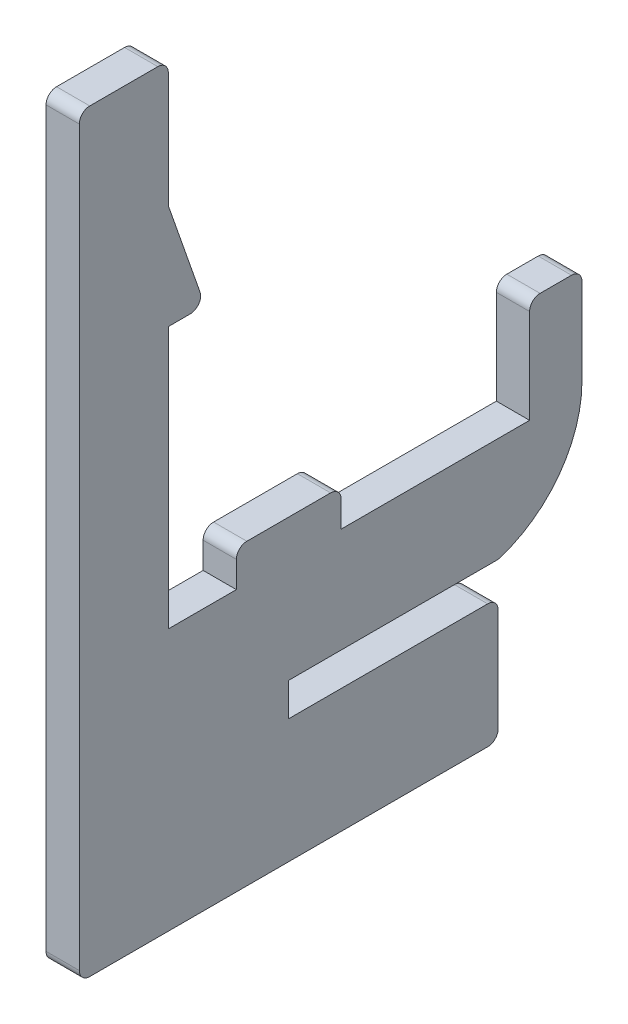
ISO-10303-21;
HEADER;
FILE_DESCRIPTION(('STEP AP214'),'2;1');
FILE_NAME('part.step','',(''),(''),'','','');
FILE_SCHEMA(('AUTOMOTIVE_DESIGN { 1 0 10303 214 1 1 1 1 }'));
ENDSEC;
DATA;
#1=APPLICATION_CONTEXT('core data for automotive mechanical design processes');
#2=APPLICATION_PROTOCOL_DEFINITION('international standard','automotive_design',2000,#1);
#3=PRODUCT_CONTEXT('',#1,'mechanical');
#4=PRODUCT('Part','Part','',(#3));
#5=PRODUCT_RELATED_PRODUCT_CATEGORY('part','',(#4));
#6=PRODUCT_DEFINITION_FORMATION('','',#4);
#7=PRODUCT_DEFINITION_CONTEXT('part definition',#1,'design');
#8=PRODUCT_DEFINITION('design','',#6,#7);
#9=PRODUCT_DEFINITION_SHAPE('','',#8);
#10=(LENGTH_UNIT() NAMED_UNIT(*) SI_UNIT(.MILLI.,.METRE.));
#11=(NAMED_UNIT(*) PLANE_ANGLE_UNIT() SI_UNIT($,.RADIAN.));
#12=(NAMED_UNIT(*) SI_UNIT($,.STERADIAN.) SOLID_ANGLE_UNIT());
#13=UNCERTAINTY_MEASURE_WITH_UNIT(LENGTH_MEASURE(1.E-05),#10,'distance_accuracy_value','');
#14=(GEOMETRIC_REPRESENTATION_CONTEXT(3) GLOBAL_UNCERTAINTY_ASSIGNED_CONTEXT((#13)) GLOBAL_UNIT_ASSIGNED_CONTEXT((#10,
#11,#12)) REPRESENTATION_CONTEXT('',''));
#15=CARTESIAN_POINT('',(0.,0.,0.));
#16=DIRECTION('',(0.,0.,1.));
#17=DIRECTION('',(1.,0.,0.));
#18=AXIS2_PLACEMENT_3D('',#15,#16,#17);
#19=CARTESIAN_POINT('',(3.175,0.721690905377064,-28.3153340080972));
#20=DIRECTION('',(-1.,0.,0.));
#21=DIRECTION('',(0.,0.,1.));
#22=AXIS2_PLACEMENT_3D('',#19,#20,#21);
#23=CYLINDRICAL_SURFACE('',#22,11.1846659919028);
#24=CARTESIAN_POINT('',(3.175,0.721690905377064,-28.3153340080972));
#25=DIRECTION('',(1.,0.,0.));
#26=DIRECTION('',(0.,0.,-1.));
#27=AXIS2_PLACEMENT_3D('',#24,#25,#26);
#28=CIRCLE('',#27,11.1846659919028);
#29=CARTESIAN_POINT('',(3.175,0.721690905377065,-39.5));
#30=VERTEX_POINT('',#29);
#31=CARTESIAN_POINT('',(3.175,-9.95454194699228,-31.649221443572));
#32=VERTEX_POINT('',#31);
#33=EDGE_CURVE('E250',#30,#32,#28,.F.);
#34=ORIENTED_EDGE('',*,*,#33,.T.);
#35=DIRECTION('',(-1.,0.,0.));
#36=VECTOR('',#35,1.);
#37=CARTESIAN_POINT('',(3.175,-9.95454194699229,-31.649221443572));
#38=LINE('',#37,#36);
#39=CARTESIAN_POINT('',(0.,-9.95454194699228,-31.649221443572));
#40=VERTEX_POINT('',#39);
#41=EDGE_CURVE('E258',#32,#40,#38,.T.);
#42=ORIENTED_EDGE('',*,*,#41,.T.);
#43=CARTESIAN_POINT('',(0.,0.721690905377064,-28.3153340080972));
#44=DIRECTION('',(1.,0.,0.));
#45=DIRECTION('',(0.,0.,-1.));
#46=AXIS2_PLACEMENT_3D('',#43,#44,#45);
#47=CIRCLE('',#46,11.1846659919028);
#48=CARTESIAN_POINT('',(0.,0.721690905377065,-39.5));
#49=VERTEX_POINT('',#48);
#50=EDGE_CURVE('E257',#49,#40,#47,.F.);
#51=ORIENTED_EDGE('',*,*,#50,.F.);
#52=DIRECTION('',(-1.,0.,0.));
#53=VECTOR('',#52,1.);
#54=CARTESIAN_POINT('',(3.175,0.721690905377065,-39.5));
#55=LINE('',#54,#53);
#56=EDGE_CURVE('E243',#30,#49,#55,.T.);
#57=ORIENTED_EDGE('',*,*,#56,.F.);
#58=EDGE_LOOP('',(#34,#42,#51,#57));
#59=FACE_BOUND('',#58,.T.);
#60=ADVANCED_FACE('F34',(#59),#23,.T.);
#61=CARTESIAN_POINT('',(3.175,0.,-39.5));
#62=DIRECTION('',(0.,0.,-1.));
#63=DIRECTION('',(-1.,0.,0.));
#64=AXIS2_PLACEMENT_3D('',#61,#62,#63);
#65=PLANE('',#64);
#66=DIRECTION('',(0.,-1.,0.));
#67=VECTOR('',#66,1.);
#68=CARTESIAN_POINT('',(0.,0.,-39.5));
#69=LINE('',#68,#67);
#70=CARTESIAN_POINT('',(0.,9.,-39.5));
#71=VERTEX_POINT('',#70);
#72=EDGE_CURVE('E319',#71,#49,#69,.T.);
#73=ORIENTED_EDGE('',*,*,#72,.F.);
#74=DIRECTION('',(-1.,0.,0.));
#75=VECTOR('',#74,1.);
#76=CARTESIAN_POINT('',(3.175,9.,-39.5));
#77=LINE('',#76,#75);
#78=CARTESIAN_POINT('',(3.175,9.,-39.5));
#79=VERTEX_POINT('',#78);
#80=EDGE_CURVE('E246',#71,#79,#77,.F.);
#81=ORIENTED_EDGE('',*,*,#80,.T.);
#82=DIRECTION('',(0.,-1.,0.));
#83=VECTOR('',#82,1.);
#84=CARTESIAN_POINT('',(3.175,0.,-39.5));
#85=LINE('',#84,#83);
#86=EDGE_CURVE('E239',#79,#30,#85,.T.);
#87=ORIENTED_EDGE('',*,*,#86,.T.);
#88=ORIENTED_EDGE('',*,*,#56,.T.);
#89=EDGE_LOOP('',(#73,#81,#87,#88));
#90=FACE_BOUND('',#89,.T.);
#91=ADVANCED_FACE('F242',(#90),#65,.T.);
#92=CARTESIAN_POINT('',(3.175,10.,0.));
#93=DIRECTION('',(0.,1.,0.));
#94=DIRECTION('',(0.,0.,1.));
#95=AXIS2_PLACEMENT_3D('',#92,#93,#94);
#96=PLANE('',#95);
#97=DIRECTION('',(0.,0.,-1.));
#98=VECTOR('',#97,1.);
#99=CARTESIAN_POINT('',(3.175,10.,0.));
#100=LINE('',#99,#98);
#101=CARTESIAN_POINT('',(3.175,10.,-35.5));
#102=VERTEX_POINT('',#101);
#103=CARTESIAN_POINT('',(3.175,10.,-38.5));
#104=VERTEX_POINT('',#103);
#105=EDGE_CURVE('E249',#102,#104,#100,.T.);
#106=ORIENTED_EDGE('',*,*,#105,.T.);
#107=DIRECTION('',(-1.,0.,0.));
#108=VECTOR('',#107,1.);
#109=CARTESIAN_POINT('',(3.175,10.,-38.5));
#110=LINE('',#109,#108);
#111=CARTESIAN_POINT('',(0.,10.,-38.5));
#112=VERTEX_POINT('',#111);
#113=EDGE_CURVE('E432',#104,#112,#110,.T.);
#114=ORIENTED_EDGE('',*,*,#113,.T.);
#115=DIRECTION('',(0.,0.,-1.));
#116=VECTOR('',#115,1.);
#117=CARTESIAN_POINT('',(0.,10.,0.));
#118=LINE('',#117,#116);
#119=CARTESIAN_POINT('',(0.,10.,-35.5));
#120=VERTEX_POINT('',#119);
#121=EDGE_CURVE('E321',#120,#112,#118,.T.);
#122=ORIENTED_EDGE('',*,*,#121,.F.);
#123=DIRECTION('',(-1.,0.,0.));
#124=VECTOR('',#123,1.);
#125=CARTESIAN_POINT('',(3.175,10.,-35.5));
#126=LINE('',#125,#124);
#127=EDGE_CURVE('E430',#120,#102,#126,.F.);
#128=ORIENTED_EDGE('',*,*,#127,.T.);
#129=EDGE_LOOP('',(#106,#114,#122,#128));
#130=FACE_BOUND('',#129,.T.);
#131=ADVANCED_FACE('F537',(#130),#96,.T.);
#132=CARTESIAN_POINT('',(3.175,0.,-34.5));
#133=DIRECTION('',(0.,0.,1.));
#134=DIRECTION('',(1.,0.,0.));
#135=AXIS2_PLACEMENT_3D('',#132,#133,#134);
#136=PLANE('',#135);
#137=DIRECTION('',(0.,1.,0.));
#138=VECTOR('',#137,1.);
#139=CARTESIAN_POINT('',(3.175,0.,-34.5));
#140=LINE('',#139,#138);
#141=CARTESIAN_POINT('',(3.175,0.,-34.5));
#142=VERTEX_POINT('',#141);
#143=CARTESIAN_POINT('',(3.175,9.,-34.5));
#144=VERTEX_POINT('',#143);
#145=EDGE_CURVE('E272',#142,#144,#140,.T.);
#146=ORIENTED_EDGE('',*,*,#145,.T.);
#147=DIRECTION('',(-1.,0.,0.));
#148=VECTOR('',#147,1.);
#149=CARTESIAN_POINT('',(3.175,9.,-34.5));
#150=LINE('',#149,#148);
#151=CARTESIAN_POINT('',(0.,9.,-34.5));
#152=VERTEX_POINT('',#151);
#153=EDGE_CURVE('E11',#144,#152,#150,.T.);
#154=ORIENTED_EDGE('',*,*,#153,.T.);
#155=DIRECTION('',(0.,1.,0.));
#156=VECTOR('',#155,1.);
#157=CARTESIAN_POINT('',(0.,0.,-34.5));
#158=LINE('',#157,#156);
#159=CARTESIAN_POINT('',(0.,0.,-34.5));
#160=VERTEX_POINT('',#159);
#161=EDGE_CURVE('E324',#160,#152,#158,.T.);
#162=ORIENTED_EDGE('',*,*,#161,.F.);
#163=DIRECTION('',(-1.,0.,0.));
#164=VECTOR('',#163,1.);
#165=CARTESIAN_POINT('',(3.175,0.,-34.5));
#166=LINE('',#165,#164);
#167=EDGE_CURVE('E259',#142,#160,#166,.T.);
#168=ORIENTED_EDGE('',*,*,#167,.F.);
#169=EDGE_LOOP('',(#146,#154,#162,#168));
#170=FACE_BOUND('',#169,.T.);
#171=ADVANCED_FACE('F545',(#170),#136,.T.);
#172=CARTESIAN_POINT('',(3.175,0.,0.));
#173=DIRECTION('',(0.,1.,0.));
#174=DIRECTION('',(0.,0.,1.));
#175=AXIS2_PLACEMENT_3D('',#172,#173,#174);
#176=PLANE('',#175);
#177=DIRECTION('',(0.,0.,-1.));
#178=VECTOR('',#177,1.);
#179=CARTESIAN_POINT('',(0.,0.,0.));
#180=LINE('',#179,#178);
#181=CARTESIAN_POINT('',(0.,0.,-16.5));
#182=VERTEX_POINT('',#181);
#183=EDGE_CURVE('E327',#182,#160,#180,.T.);
#184=ORIENTED_EDGE('',*,*,#183,.F.);
#185=DIRECTION('',(-1.,0.,0.));
#186=VECTOR('',#185,1.);
#187=CARTESIAN_POINT('',(3.175,0.,-16.5));
#188=LINE('',#187,#186);
#189=CARTESIAN_POINT('',(3.175,0.,-16.5));
#190=VERTEX_POINT('',#189);
#191=EDGE_CURVE('E381',#190,#182,#188,.T.);
#192=ORIENTED_EDGE('',*,*,#191,.F.);
#193=DIRECTION('',(0.,0.,-1.));
#194=VECTOR('',#193,1.);
#195=CARTESIAN_POINT('',(3.175,0.,0.));
#196=LINE('',#195,#194);
#197=EDGE_CURVE('E275',#190,#142,#196,.T.);
#198=ORIENTED_EDGE('',*,*,#197,.T.);
#199=ORIENTED_EDGE('',*,*,#167,.T.);
#200=EDGE_LOOP('',(#184,#192,#198,#199));
#201=FACE_BOUND('',#200,.T.);
#202=ADVANCED_FACE('F549',(#201),#176,.T.);
#203=CARTESIAN_POINT('',(3.175,0.,-16.5));
#204=DIRECTION('',(0.,0.,-1.));
#205=DIRECTION('',(-1.,0.,0.));
#206=AXIS2_PLACEMENT_3D('',#203,#204,#205);
#207=PLANE('',#206);
#208=DIRECTION('',(0.,-1.,0.));
#209=VECTOR('',#208,1.);
#210=CARTESIAN_POINT('',(0.,0.,-16.5));
#211=LINE('',#210,#209);
#212=CARTESIAN_POINT('',(0.,2.5,-16.5));
#213=VERTEX_POINT('',#212);
#214=EDGE_CURVE('E330',#213,#182,#211,.T.);
#215=ORIENTED_EDGE('',*,*,#214,.F.);
#216=DIRECTION('',(-1.,0.,0.));
#217=VECTOR('',#216,1.);
#218=CARTESIAN_POINT('',(3.175,2.5,-16.5));
#219=LINE('',#218,#217);
#220=CARTESIAN_POINT('',(3.175,2.5,-16.5));
#221=VERTEX_POINT('',#220);
#222=EDGE_CURVE('E466',#213,#221,#219,.F.);
#223=ORIENTED_EDGE('',*,*,#222,.T.);
#224=DIRECTION('',(0.,-1.,0.));
#225=VECTOR('',#224,1.);
#226=CARTESIAN_POINT('',(3.175,0.,-16.5));
#227=LINE('',#226,#225);
#228=EDGE_CURVE('E278',#221,#190,#227,.T.);
#229=ORIENTED_EDGE('',*,*,#228,.T.);
#230=ORIENTED_EDGE('',*,*,#191,.T.);
#231=EDGE_LOOP('',(#215,#223,#229,#230));
#232=FACE_BOUND('',#231,.T.);
#233=ADVANCED_FACE('F798',(#232),#207,.T.);
#234=CARTESIAN_POINT('',(3.175,3.5,0.));
#235=DIRECTION('',(0.,1.,0.));
#236=DIRECTION('',(0.,0.,1.));
#237=AXIS2_PLACEMENT_3D('',#234,#235,#236);
#238=PLANE('',#237);
#239=DIRECTION('',(0.,0.,-1.));
#240=VECTOR('',#239,1.);
#241=CARTESIAN_POINT('',(0.,3.5,0.));
#242=LINE('',#241,#240);
#243=CARTESIAN_POINT('',(0.,3.5,-7.5));
#244=VERTEX_POINT('',#243);
#245=CARTESIAN_POINT('',(0.,3.5,-15.5));
#246=VERTEX_POINT('',#245);
#247=EDGE_CURVE('E332',#244,#246,#242,.T.);
#248=ORIENTED_EDGE('',*,*,#247,.F.);
#249=DIRECTION('',(-1.,0.,0.));
#250=VECTOR('',#249,1.);
#251=CARTESIAN_POINT('',(3.175,3.5,-7.5));
#252=LINE('',#251,#250);
#253=CARTESIAN_POINT('',(3.175,3.5,-7.5));
#254=VERTEX_POINT('',#253);
#255=EDGE_CURVE('E464',#244,#254,#252,.F.);
#256=ORIENTED_EDGE('',*,*,#255,.T.);
#257=DIRECTION('',(0.,0.,-1.));
#258=VECTOR('',#257,1.);
#259=CARTESIAN_POINT('',(3.175,3.5,0.));
#260=LINE('',#259,#258);
#261=CARTESIAN_POINT('',(3.175,3.5,-15.5));
#262=VERTEX_POINT('',#261);
#263=EDGE_CURVE('E280',#254,#262,#260,.T.);
#264=ORIENTED_EDGE('',*,*,#263,.T.);
#265=DIRECTION('',(-1.,0.,0.));
#266=VECTOR('',#265,1.);
#267=CARTESIAN_POINT('',(3.175,3.5,-15.5));
#268=LINE('',#267,#266);
#269=EDGE_CURVE('E461',#262,#246,#268,.T.);
#270=ORIENTED_EDGE('',*,*,#269,.T.);
#271=EDGE_LOOP('',(#248,#256,#264,#270));
#272=FACE_BOUND('',#271,.T.);
#273=ADVANCED_FACE('F561',(#272),#238,.T.);
#274=CARTESIAN_POINT('',(3.175,0.,-6.5));
#275=DIRECTION('',(0.,0.,1.));
#276=DIRECTION('',(1.,0.,0.));
#277=AXIS2_PLACEMENT_3D('',#274,#275,#276);
#278=PLANE('',#277);
#279=DIRECTION('',(0.,1.,0.));
#280=VECTOR('',#279,1.);
#281=CARTESIAN_POINT('',(3.175,0.,-6.5));
#282=LINE('',#281,#280);
#283=CARTESIAN_POINT('',(3.175,0.,-6.5));
#284=VERTEX_POINT('',#283);
#285=CARTESIAN_POINT('',(3.175,2.5,-6.5));
#286=VERTEX_POINT('',#285);
#287=EDGE_CURVE('E283',#284,#286,#282,.T.);
#288=ORIENTED_EDGE('',*,*,#287,.T.);
#289=DIRECTION('',(-1.,0.,0.));
#290=VECTOR('',#289,1.);
#291=CARTESIAN_POINT('',(3.175,2.5,-6.5));
#292=LINE('',#291,#290);
#293=CARTESIAN_POINT('',(0.,2.5,-6.5));
#294=VERTEX_POINT('',#293);
#295=EDGE_CURVE('E458',#286,#294,#292,.T.);
#296=ORIENTED_EDGE('',*,*,#295,.T.);
#297=DIRECTION('',(0.,1.,0.));
#298=VECTOR('',#297,1.);
#299=CARTESIAN_POINT('',(0.,0.,-6.5));
#300=LINE('',#299,#298);
#301=CARTESIAN_POINT('',(0.,0.,-6.5));
#302=VERTEX_POINT('',#301);
#303=EDGE_CURVE('E335',#302,#294,#300,.T.);
#304=ORIENTED_EDGE('',*,*,#303,.F.);
#305=DIRECTION('',(-1.,0.,0.));
#306=VECTOR('',#305,1.);
#307=CARTESIAN_POINT('',(3.175,0.,-6.5));
#308=LINE('',#307,#306);
#309=EDGE_CURVE('E379',#284,#302,#308,.T.);
#310=ORIENTED_EDGE('',*,*,#309,.F.);
#311=EDGE_LOOP('',(#288,#296,#304,#310));
#312=FACE_BOUND('',#311,.T.);
#313=ADVANCED_FACE('F570',(#312),#278,.T.);
#314=CARTESIAN_POINT('',(3.175,0.,0.));
#315=DIRECTION('',(0.,1.,0.));
#316=DIRECTION('',(0.,0.,1.));
#317=AXIS2_PLACEMENT_3D('',#314,#315,#316);
#318=PLANE('',#317);
#319=DIRECTION('',(0.,0.,-1.));
#320=VECTOR('',#319,1.);
#321=CARTESIAN_POINT('',(0.,0.,0.));
#322=LINE('',#321,#320);
#323=CARTESIAN_POINT('',(0.,0.,0.));
#324=VERTEX_POINT('',#323);
#325=EDGE_CURVE('E338',#324,#302,#322,.T.);
#326=ORIENTED_EDGE('',*,*,#325,.F.);
#327=DIRECTION('',(-1.,0.,0.));
#328=VECTOR('',#327,1.);
#329=CARTESIAN_POINT('',(3.175,0.,0.));
#330=LINE('',#329,#328);
#331=CARTESIAN_POINT('',(3.175,0.,0.));
#332=VERTEX_POINT('',#331);
#333=EDGE_CURVE('E377',#332,#324,#330,.T.);
#334=ORIENTED_EDGE('',*,*,#333,.F.);
#335=DIRECTION('',(0.,0.,-1.));
#336=VECTOR('',#335,1.);
#337=CARTESIAN_POINT('',(3.175,0.,0.));
#338=LINE('',#337,#336);
#339=EDGE_CURVE('E286',#332,#284,#338,.T.);
#340=ORIENTED_EDGE('',*,*,#339,.T.);
#341=ORIENTED_EDGE('',*,*,#309,.T.);
#342=EDGE_LOOP('',(#326,#334,#340,#341));
#343=FACE_BOUND('',#342,.T.);
#344=ADVANCED_FACE('F575',(#343),#318,.T.);
#345=CARTESIAN_POINT('',(3.175,0.,0.));
#346=DIRECTION('',(0.,0.,1.));
#347=DIRECTION('',(1.,0.,0.));
#348=AXIS2_PLACEMENT_3D('',#345,#346,#347);
#349=PLANE('',#348);
#350=DIRECTION('',(0.,1.,0.));
#351=VECTOR('',#350,1.);
#352=CARTESIAN_POINT('',(0.,0.,0.));
#353=LINE('',#352,#351);
#354=CARTESIAN_POINT('',(0.,25.,0.));
#355=VERTEX_POINT('',#354);
#356=EDGE_CURVE('E341',#324,#355,#353,.T.);
#357=ORIENTED_EDGE('',*,*,#356,.T.);
#358=DIRECTION('',(-1.,0.,0.));
#359=VECTOR('',#358,1.);
#360=CARTESIAN_POINT('',(3.175,25.,0.));
#361=LINE('',#360,#359);
#362=CARTESIAN_POINT('',(3.175,25.,0.));
#363=VERTEX_POINT('',#362);
#364=EDGE_CURVE('E374',#363,#355,#361,.T.);
#365=ORIENTED_EDGE('',*,*,#364,.F.);
#366=DIRECTION('',(0.,1.,0.));
#367=VECTOR('',#366,1.);
#368=CARTESIAN_POINT('',(3.175,0.,0.));
#369=LINE('',#368,#367);
#370=EDGE_CURVE('E289',#332,#363,#369,.T.);
#371=ORIENTED_EDGE('',*,*,#370,.F.);
#372=ORIENTED_EDGE('',*,*,#333,.T.);
#373=EDGE_LOOP('',(#357,#365,#371,#372));
#374=FACE_BOUND('',#373,.T.);
#375=ADVANCED_FACE('F580',(#374),#349,.F.);
#376=CARTESIAN_POINT('',(3.175,25.,0.));
#377=DIRECTION('',(0.,1.,0.));
#378=DIRECTION('',(0.,0.,1.));
#379=AXIS2_PLACEMENT_3D('',#376,#377,#378);
#380=PLANE('',#379);
#381=DIRECTION('',(0.,0.,-1.));
#382=VECTOR('',#381,1.);
#383=CARTESIAN_POINT('',(0.,25.,0.));
#384=LINE('',#383,#382);
#385=CARTESIAN_POINT('',(0.,25.,-2.09051899497915));
#386=VERTEX_POINT('',#385);
#387=EDGE_CURVE('E343',#355,#386,#384,.T.);
#388=ORIENTED_EDGE('',*,*,#387,.T.);
#389=DIRECTION('',(-1.,0.,0.));
#390=VECTOR('',#389,1.);
#391=CARTESIAN_POINT('',(3.175,25.,-2.09051899497915));
#392=LINE('',#391,#390);
#393=CARTESIAN_POINT('',(3.175,25.,-2.09051899497915));
#394=VERTEX_POINT('',#393);
#395=EDGE_CURVE('E439',#386,#394,#392,.F.);
#396=ORIENTED_EDGE('',*,*,#395,.T.);
#397=DIRECTION('',(0.,0.,-1.));
#398=VECTOR('',#397,1.);
#399=CARTESIAN_POINT('',(3.175,25.,0.));
#400=LINE('',#399,#398);
#401=EDGE_CURVE('E291',#363,#394,#400,.T.);
#402=ORIENTED_EDGE('',*,*,#401,.F.);
#403=ORIENTED_EDGE('',*,*,#364,.T.);
#404=EDGE_LOOP('',(#388,#396,#402,#403));
#405=FACE_BOUND('',#404,.T.);
#406=ADVANCED_FACE('F592',(#405),#380,.F.);
#407=CARTESIAN_POINT('',(3.175,3.8195991091314,-10.913140311804));
#408=DIRECTION('',(0.,-0.330350424728106,0.943858356366017));
#409=DIRECTION('',(0.,-0.943858356366018,-0.330350424728106));
#410=AXIS2_PLACEMENT_3D('',#407,#408,#409);
#411=PLANE('',#410);
#412=DIRECTION('',(0.,0.943858356366018,0.330350424728106));
#413=VECTOR('',#412,1.);
#414=CARTESIAN_POINT('',(3.175,3.8195991091314,-10.913140311804));
#415=LINE('',#414,#413);
#416=CARTESIAN_POINT('',(3.175,26.3303504247281,-3.03437735134516));
#417=VERTEX_POINT('',#416);
#418=CARTESIAN_POINT('',(3.175,35.,0.));
#419=VERTEX_POINT('',#418);
#420=EDGE_CURVE('E294',#417,#419,#415,.T.);
#421=ORIENTED_EDGE('',*,*,#420,.F.);
#422=DIRECTION('',(-1.,0.,0.));
#423=VECTOR('',#422,1.);
#424=CARTESIAN_POINT('',(3.175,26.3303504247281,-3.03437735134516));
#425=LINE('',#424,#423);
#426=CARTESIAN_POINT('',(0.,26.3303504247281,-3.03437735134516));
#427=VERTEX_POINT('',#426);
#428=EDGE_CURVE('E436',#417,#427,#425,.T.);
#429=ORIENTED_EDGE('',*,*,#428,.T.);
#430=DIRECTION('',(0.,0.943858356366018,0.330350424728106));
#431=VECTOR('',#430,1.);
#432=CARTESIAN_POINT('',(0.,3.8195991091314,-10.913140311804));
#433=LINE('',#432,#431);
#434=CARTESIAN_POINT('',(0.,35.,0.));
#435=VERTEX_POINT('',#434);
#436=EDGE_CURVE('E346',#427,#435,#433,.T.);
#437=ORIENTED_EDGE('',*,*,#436,.T.);
#438=DIRECTION('',(-1.,0.,0.));
#439=VECTOR('',#438,1.);
#440=CARTESIAN_POINT('',(3.175,35.,0.));
#441=LINE('',#440,#439);
#442=EDGE_CURVE('E371',#419,#435,#441,.T.);
#443=ORIENTED_EDGE('',*,*,#442,.F.);
#444=EDGE_LOOP('',(#421,#429,#437,#443));
#445=FACE_BOUND('',#444,.T.);
#446=ADVANCED_FACE('F590',(#445),#411,.F.);
#447=CARTESIAN_POINT('',(3.175,0.,0.));
#448=DIRECTION('',(0.,0.,1.));
#449=DIRECTION('',(1.,0.,0.));
#450=AXIS2_PLACEMENT_3D('',#447,#448,#449);
#451=PLANE('',#450);
#452=DIRECTION('',(0.,1.,0.));
#453=VECTOR('',#452,1.);
#454=CARTESIAN_POINT('',(0.,0.,0.));
#455=LINE('',#454,#453);
#456=CARTESIAN_POINT('',(0.,46.,0.));
#457=VERTEX_POINT('',#456);
#458=EDGE_CURVE('E348',#435,#457,#455,.T.);
#459=ORIENTED_EDGE('',*,*,#458,.T.);
#460=DIRECTION('',(-1.,0.,0.));
#461=VECTOR('',#460,1.);
#462=CARTESIAN_POINT('',(3.175,46.,0.));
#463=LINE('',#462,#461);
#464=CARTESIAN_POINT('',(3.175,46.,0.));
#465=VERTEX_POINT('',#464);
#466=EDGE_CURVE('E42',#457,#465,#463,.F.);
#467=ORIENTED_EDGE('',*,*,#466,.T.);
#468=DIRECTION('',(0.,1.,0.));
#469=VECTOR('',#468,1.);
#470=CARTESIAN_POINT('',(3.175,0.,0.));
#471=LINE('',#470,#469);
#472=EDGE_CURVE('E296',#419,#465,#471,.T.);
#473=ORIENTED_EDGE('',*,*,#472,.F.);
#474=ORIENTED_EDGE('',*,*,#442,.T.);
#475=EDGE_LOOP('',(#459,#467,#473,#474));
#476=FACE_BOUND('',#475,.T.);
#477=ADVANCED_FACE('F475',(#476),#451,.F.);
#478=CARTESIAN_POINT('',(3.175,47.,0.));
#479=DIRECTION('',(0.,-1.,0.));
#480=DIRECTION('',(0.,0.,-1.));
#481=AXIS2_PLACEMENT_3D('',#478,#479,#480);
#482=PLANE('',#481);
#483=DIRECTION('',(0.,0.,1.));
#484=VECTOR('',#483,1.);
#485=CARTESIAN_POINT('',(0.,47.,0.));
#486=LINE('',#485,#484);
#487=CARTESIAN_POINT('',(0.,47.,1.));
#488=VERTEX_POINT('',#487);
#489=CARTESIAN_POINT('',(0.,47.,7.5));
#490=VERTEX_POINT('',#489);
#491=EDGE_CURVE('E351',#488,#490,#486,.T.);
#492=ORIENTED_EDGE('',*,*,#491,.T.);
#493=DIRECTION('',(-1.,0.,0.));
#494=VECTOR('',#493,1.);
#495=CARTESIAN_POINT('',(3.175,47.,7.5));
#496=LINE('',#495,#494);
#497=CARTESIAN_POINT('',(3.175,47.,7.5));
#498=VERTEX_POINT('',#497);
#499=EDGE_CURVE('E471',#490,#498,#496,.F.);
#500=ORIENTED_EDGE('',*,*,#499,.T.);
#501=DIRECTION('',(0.,0.,1.));
#502=VECTOR('',#501,1.);
#503=CARTESIAN_POINT('',(3.175,47.,0.));
#504=LINE('',#503,#502);
#505=CARTESIAN_POINT('',(3.175,47.,1.));
#506=VERTEX_POINT('',#505);
#507=EDGE_CURVE('E299',#506,#498,#504,.T.);
#508=ORIENTED_EDGE('',*,*,#507,.F.);
#509=DIRECTION('',(-1.,0.,0.));
#510=VECTOR('',#509,1.);
#511=CARTESIAN_POINT('',(3.175,47.,1.));
#512=LINE('',#511,#510);
#513=EDGE_CURVE('E468',#506,#488,#512,.T.);
#514=ORIENTED_EDGE('',*,*,#513,.T.);
#515=EDGE_LOOP('',(#492,#500,#508,#514));
#516=FACE_BOUND('',#515,.T.);
#517=ADVANCED_FACE('F486',(#516),#482,.F.);
#518=CARTESIAN_POINT('',(3.175,0.,8.5));
#519=DIRECTION('',(0.,0.,-1.));
#520=DIRECTION('',(-1.,0.,0.));
#521=AXIS2_PLACEMENT_3D('',#518,#519,#520);
#522=PLANE('',#521);
#523=DIRECTION('',(0.,-1.,0.));
#524=VECTOR('',#523,1.);
#525=CARTESIAN_POINT('',(0.,0.,8.5));
#526=LINE('',#525,#524);
#527=CARTESIAN_POINT('',(0.,46.,8.5));
#528=VERTEX_POINT('',#527);
#529=CARTESIAN_POINT('',(0.,-24.,8.5));
#530=VERTEX_POINT('',#529);
#531=EDGE_CURVE('E354',#528,#530,#526,.T.);
#532=ORIENTED_EDGE('',*,*,#531,.T.);
#533=DIRECTION('',(-1.,0.,0.));
#534=VECTOR('',#533,1.);
#535=CARTESIAN_POINT('',(3.175,-24.,8.5));
#536=LINE('',#535,#534);
#537=CARTESIAN_POINT('',(3.175,-24.,8.5));
#538=VERTEX_POINT('',#537);
#539=EDGE_CURVE('E449',#530,#538,#536,.F.);
#540=ORIENTED_EDGE('',*,*,#539,.T.);
#541=DIRECTION('',(0.,-1.,0.));
#542=VECTOR('',#541,1.);
#543=CARTESIAN_POINT('',(3.175,0.,8.5));
#544=LINE('',#543,#542);
#545=CARTESIAN_POINT('',(3.175,46.,8.5));
#546=VERTEX_POINT('',#545);
#547=EDGE_CURVE('E302',#546,#538,#544,.T.);
#548=ORIENTED_EDGE('',*,*,#547,.F.);
#549=DIRECTION('',(-1.,0.,0.));
#550=VECTOR('',#549,1.);
#551=CARTESIAN_POINT('',(3.175,46.,8.5));
#552=LINE('',#551,#550);
#553=EDGE_CURVE('E446',#546,#528,#552,.T.);
#554=ORIENTED_EDGE('',*,*,#553,.T.);
#555=EDGE_LOOP('',(#532,#540,#548,#554));
#556=FACE_BOUND('',#555,.T.);
#557=ADVANCED_FACE('F497',(#556),#522,.F.);
#558=CARTESIAN_POINT('',(3.175,-25.,0.));
#559=DIRECTION('',(0.,1.,0.));
#560=DIRECTION('',(0.,0.,1.));
#561=AXIS2_PLACEMENT_3D('',#558,#559,#560);
#562=PLANE('',#561);
#563=DIRECTION('',(0.,0.,-1.));
#564=VECTOR('',#563,1.);
#565=CARTESIAN_POINT('',(3.175,-25.,0.));
#566=LINE('',#565,#564);
#567=CARTESIAN_POINT('',(3.175,-25.,7.5));
#568=VERTEX_POINT('',#567);
#569=CARTESIAN_POINT('',(3.175,-25.,-30.5));
#570=VERTEX_POINT('',#569);
#571=EDGE_CURVE('E305',#568,#570,#566,.T.);
#572=ORIENTED_EDGE('',*,*,#571,.F.);
#573=DIRECTION('',(-1.,0.,0.));
#574=VECTOR('',#573,1.);
#575=CARTESIAN_POINT('',(3.175,-25.,7.5));
#576=LINE('',#575,#574);
#577=CARTESIAN_POINT('',(0.,-25.,7.5));
#578=VERTEX_POINT('',#577);
#579=EDGE_CURVE('E443',#568,#578,#576,.T.);
#580=ORIENTED_EDGE('',*,*,#579,.T.);
#581=DIRECTION('',(0.,0.,-1.));
#582=VECTOR('',#581,1.);
#583=CARTESIAN_POINT('',(0.,-25.,0.));
#584=LINE('',#583,#582);
#585=CARTESIAN_POINT('',(0.,-25.,-30.5));
#586=VERTEX_POINT('',#585);
#587=EDGE_CURVE('E357',#578,#586,#584,.T.);
#588=ORIENTED_EDGE('',*,*,#587,.T.);
#589=DIRECTION('',(-1.,0.,0.));
#590=VECTOR('',#589,1.);
#591=CARTESIAN_POINT('',(3.175,-25.,-30.5));
#592=LINE('',#591,#590);
#593=EDGE_CURVE('E441',#586,#570,#592,.F.);
#594=ORIENTED_EDGE('',*,*,#593,.T.);
#595=EDGE_LOOP('',(#572,#580,#588,#594));
#596=FACE_BOUND('',#595,.T.);
#597=ADVANCED_FACE('F506',(#596),#562,.F.);
#598=CARTESIAN_POINT('',(3.175,0.,-31.5));
#599=DIRECTION('',(0.,0.,1.));
#600=DIRECTION('',(0.,-1.,0.));
#601=AXIS2_PLACEMENT_3D('',#598,#599,#600);
#602=PLANE('',#601);
#603=DIRECTION('',(0.,1.,0.));
#604=VECTOR('',#603,1.);
#605=CARTESIAN_POINT('',(3.175,0.,-31.5));
#606=LINE('',#605,#604);
#607=CARTESIAN_POINT('',(3.175,-24.,-31.5));
#608=VERTEX_POINT('',#607);
#609=CARTESIAN_POINT('',(3.175,-14.175,-31.5));
#610=VERTEX_POINT('',#609);
#611=EDGE_CURVE('E308',#608,#610,#606,.T.);
#612=ORIENTED_EDGE('',*,*,#611,.F.);
#613=DIRECTION('',(-1.,0.,0.));
#614=VECTOR('',#613,1.);
#615=CARTESIAN_POINT('',(3.175,-24.,-31.5));
#616=LINE('',#615,#614);
#617=CARTESIAN_POINT('',(0.,-24.,-31.5));
#618=VERTEX_POINT('',#617);
#619=EDGE_CURVE('E452',#608,#618,#616,.T.);
#620=ORIENTED_EDGE('',*,*,#619,.T.);
#621=DIRECTION('',(0.,1.,0.));
#622=VECTOR('',#621,1.);
#623=CARTESIAN_POINT('',(0.,0.,-31.5));
#624=LINE('',#623,#622);
#625=CARTESIAN_POINT('',(0.,-14.175,-31.5));
#626=VERTEX_POINT('',#625);
#627=EDGE_CURVE('E360',#618,#626,#624,.T.);
#628=ORIENTED_EDGE('',*,*,#627,.T.);
#629=DIRECTION('',(-1.,0.,0.));
#630=VECTOR('',#629,1.);
#631=CARTESIAN_POINT('',(3.175,-14.175,-31.5));
#632=LINE('',#631,#630);
#633=EDGE_CURVE('E57',#626,#610,#632,.F.);
#634=ORIENTED_EDGE('',*,*,#633,.T.);
#635=EDGE_LOOP('',(#612,#620,#628,#634));
#636=FACE_BOUND('',#635,.T.);
#637=ADVANCED_FACE('F513',(#636),#602,.F.);
#638=CARTESIAN_POINT('',(3.175,-13.175,0.));
#639=DIRECTION('',(0.,-1.,0.));
#640=DIRECTION('',(0.,0.,-1.));
#641=AXIS2_PLACEMENT_3D('',#638,#639,#640);
#642=PLANE('',#641);
#643=DIRECTION('',(0.,0.,1.));
#644=VECTOR('',#643,1.);
#645=CARTESIAN_POINT('',(3.175,-13.175,0.));
#646=LINE('',#645,#644);
#647=CARTESIAN_POINT('',(3.175,-13.175,-30.5));
#648=VERTEX_POINT('',#647);
#649=CARTESIAN_POINT('',(3.175,-13.175,-11.5));
#650=VERTEX_POINT('',#649);
#651=EDGE_CURVE('E310',#648,#650,#646,.T.);
#652=ORIENTED_EDGE('',*,*,#651,.F.);
#653=DIRECTION('',(-1.,0.,0.));
#654=VECTOR('',#653,1.);
#655=CARTESIAN_POINT('',(3.175,-13.175,-30.5));
#656=LINE('',#655,#654);
#657=CARTESIAN_POINT('',(0.,-13.175,-30.5));
#658=VERTEX_POINT('',#657);
#659=EDGE_CURVE('E455',#648,#658,#656,.T.);
#660=ORIENTED_EDGE('',*,*,#659,.T.);
#661=DIRECTION('',(0.,0.,1.));
#662=VECTOR('',#661,1.);
#663=CARTESIAN_POINT('',(0.,-13.175,0.));
#664=LINE('',#663,#662);
#665=CARTESIAN_POINT('',(0.,-13.175,-11.5));
#666=VERTEX_POINT('',#665);
#667=EDGE_CURVE('E362',#658,#666,#664,.T.);
#668=ORIENTED_EDGE('',*,*,#667,.T.);
#669=DIRECTION('',(-1.,0.,0.));
#670=VECTOR('',#669,1.);
#671=CARTESIAN_POINT('',(3.175,-13.175,-11.5));
#672=LINE('',#671,#670);
#673=EDGE_CURVE('E368',#650,#666,#672,.T.);
#674=ORIENTED_EDGE('',*,*,#673,.F.);
#675=EDGE_LOOP('',(#652,#660,#668,#674));
#676=FACE_BOUND('',#675,.T.);
#677=ADVANCED_FACE('F519',(#676),#642,.F.);
#678=CARTESIAN_POINT('',(3.175,0.,-11.5));
#679=DIRECTION('',(0.,0.,1.));
#680=DIRECTION('',(1.,0.,0.));
#681=AXIS2_PLACEMENT_3D('',#678,#679,#680);
#682=PLANE('',#681);
#683=DIRECTION('',(0.,1.,0.));
#684=VECTOR('',#683,1.);
#685=CARTESIAN_POINT('',(0.,0.,-11.5));
#686=LINE('',#685,#684);
#687=CARTESIAN_POINT('',(0.,-10.,-11.5));
#688=VERTEX_POINT('',#687);
#689=EDGE_CURVE('E267',#666,#688,#686,.T.);
#690=ORIENTED_EDGE('',*,*,#689,.T.);
#691=DIRECTION('',(-1.,0.,0.));
#692=VECTOR('',#691,1.);
#693=CARTESIAN_POINT('',(3.175,-10.,-11.5));
#694=LINE('',#693,#692);
#695=CARTESIAN_POINT('',(3.175,-10.,-11.5));
#696=VERTEX_POINT('',#695);
#697=EDGE_CURVE('E317',#696,#688,#694,.T.);
#698=ORIENTED_EDGE('',*,*,#697,.F.);
#699=DIRECTION('',(0.,1.,0.));
#700=VECTOR('',#699,1.);
#701=CARTESIAN_POINT('',(3.175,0.,-11.5));
#702=LINE('',#701,#700);
#703=EDGE_CURVE('E312',#650,#696,#702,.T.);
#704=ORIENTED_EDGE('',*,*,#703,.F.);
#705=ORIENTED_EDGE('',*,*,#673,.T.);
#706=EDGE_LOOP('',(#690,#698,#704,#705));
#707=FACE_BOUND('',#706,.T.);
#708=ADVANCED_FACE('F525',(#707),#682,.F.);
#709=CARTESIAN_POINT('',(3.175,-10.,0.));
#710=DIRECTION('',(0.,-1.,0.));
#711=DIRECTION('',(0.,0.,-1.));
#712=AXIS2_PLACEMENT_3D('',#709,#710,#711);
#713=PLANE('',#712);
#714=DIRECTION('',(0.,0.,1.));
#715=VECTOR('',#714,1.);
#716=CARTESIAN_POINT('',(0.,-10.,0.));
#717=LINE('',#716,#715);
#718=CARTESIAN_POINT('',(0.,-10.,-31.3511448235023));
#719=VERTEX_POINT('',#718);
#720=EDGE_CURVE('E265',#719,#688,#717,.T.);
#721=ORIENTED_EDGE('',*,*,#720,.F.);
#722=DIRECTION('',(-1.,0.,0.));
#723=VECTOR('',#722,1.);
#724=CARTESIAN_POINT('',(3.175,-10.,-31.3511448235023));
#725=LINE('',#724,#723);
#726=CARTESIAN_POINT('',(3.175,-10.,-31.3511448235023));
#727=VERTEX_POINT('',#726);
#728=EDGE_CURVE('E408',#719,#727,#725,.F.);
#729=ORIENTED_EDGE('',*,*,#728,.T.);
#730=DIRECTION('',(0.,0.,1.));
#731=VECTOR('',#730,1.);
#732=CARTESIAN_POINT('',(3.175,-10.,0.));
#733=LINE('',#732,#731);
#734=EDGE_CURVE('E315',#727,#696,#733,.T.);
#735=ORIENTED_EDGE('',*,*,#734,.T.);
#736=ORIENTED_EDGE('',*,*,#697,.T.);
#737=EDGE_LOOP('',(#721,#729,#735,#736));
#738=FACE_BOUND('',#737,.T.);
#739=ADVANCED_FACE('F708',(#738),#713,.T.);
#740=CARTESIAN_POINT('',(3.175,0.,0.));
#741=DIRECTION('',(1.,0.,0.));
#742=DIRECTION('',(0.,0.,-1.));
#743=AXIS2_PLACEMENT_3D('',#740,#741,#742);
#744=PLANE('',#743);
#745=ORIENTED_EDGE('',*,*,#734,.F.);
#746=CARTESIAN_POINT('',(3.175,-9.,-31.3511448235023));
#747=DIRECTION('',(1.,0.,0.));
#748=DIRECTION('',(0.,0.,-1.));
#749=AXIS2_PLACEMENT_3D('',#746,#747,#748);
#750=CIRCLE('',#749,1.);
#751=EDGE_CURVE('E264',#727,#32,#750,.T.);
#752=ORIENTED_EDGE('',*,*,#751,.T.);
#753=ORIENTED_EDGE('',*,*,#33,.F.);
#754=ORIENTED_EDGE('',*,*,#86,.F.);
#755=CARTESIAN_POINT('',(3.175,9.,-38.5));
#756=DIRECTION('',(1.,0.,0.));
#757=DIRECTION('',(0.,0.,-1.));
#758=AXIS2_PLACEMENT_3D('',#755,#756,#757);
#759=CIRCLE('',#758,1.);
#760=EDGE_CURVE('E427',#79,#104,#759,.T.);
#761=ORIENTED_EDGE('',*,*,#760,.T.);
#762=ORIENTED_EDGE('',*,*,#105,.F.);
#763=CARTESIAN_POINT('',(3.175,9.,-35.5));
#764=DIRECTION('',(1.,0.,0.));
#765=DIRECTION('',(0.,0.,-1.));
#766=AXIS2_PLACEMENT_3D('',#763,#764,#765);
#767=CIRCLE('',#766,1.);
#768=EDGE_CURVE('E410',#102,#144,#767,.T.);
#769=ORIENTED_EDGE('',*,*,#768,.T.);
#770=ORIENTED_EDGE('',*,*,#145,.F.);
#771=ORIENTED_EDGE('',*,*,#197,.F.);
#772=ORIENTED_EDGE('',*,*,#228,.F.);
#773=CARTESIAN_POINT('',(3.175,2.5,-15.5));
#774=DIRECTION('',(1.,0.,0.));
#775=DIRECTION('',(0.,0.,-1.));
#776=AXIS2_PLACEMENT_3D('',#773,#774,#775);
#777=CIRCLE('',#776,1.);
#778=EDGE_CURVE('E416',#221,#262,#777,.T.);
#779=ORIENTED_EDGE('',*,*,#778,.T.);
#780=ORIENTED_EDGE('',*,*,#263,.F.);
#781=CARTESIAN_POINT('',(3.175,2.5,-7.5));
#782=DIRECTION('',(1.,0.,0.));
#783=DIRECTION('',(0.,0.,-1.));
#784=AXIS2_PLACEMENT_3D('',#781,#782,#783);
#785=CIRCLE('',#784,1.);
#786=EDGE_CURVE('E418',#254,#286,#785,.T.);
#787=ORIENTED_EDGE('',*,*,#786,.T.);
#788=ORIENTED_EDGE('',*,*,#287,.F.);
#789=ORIENTED_EDGE('',*,*,#339,.F.);
#790=ORIENTED_EDGE('',*,*,#370,.T.);
#791=ORIENTED_EDGE('',*,*,#401,.T.);
#792=CARTESIAN_POINT('',(3.175,26.,-2.09051899497915));
#793=DIRECTION('',(1.,0.,0.));
#794=DIRECTION('',(0.,0.,-1.));
#795=AXIS2_PLACEMENT_3D('',#792,#793,#794);
#796=CIRCLE('',#795,1.);
#797=EDGE_CURVE('E425',#394,#417,#796,.T.);
#798=ORIENTED_EDGE('',*,*,#797,.T.);
#799=ORIENTED_EDGE('',*,*,#420,.T.);
#800=ORIENTED_EDGE('',*,*,#472,.T.);
#801=CARTESIAN_POINT('',(3.175,46.,1.));
#802=DIRECTION('',(1.,0.,0.));
#803=DIRECTION('',(0.,0.,-1.));
#804=AXIS2_PLACEMENT_3D('',#801,#802,#803);
#805=CIRCLE('',#804,1.);
#806=EDGE_CURVE('E412',#465,#506,#805,.T.);
#807=ORIENTED_EDGE('',*,*,#806,.T.);
#808=ORIENTED_EDGE('',*,*,#507,.T.);
#809=CARTESIAN_POINT('',(3.175,46.,7.5));
#810=DIRECTION('',(1.,0.,0.));
#811=DIRECTION('',(0.,0.,-1.));
#812=AXIS2_PLACEMENT_3D('',#809,#810,#811);
#813=CIRCLE('',#812,1.);
#814=EDGE_CURVE('E414',#498,#546,#813,.T.);
#815=ORIENTED_EDGE('',*,*,#814,.T.);
#816=ORIENTED_EDGE('',*,*,#547,.T.);
#817=CARTESIAN_POINT('',(3.175,-24.,7.5));
#818=DIRECTION('',(1.,0.,0.));
#819=DIRECTION('',(0.,0.,-1.));
#820=AXIS2_PLACEMENT_3D('',#817,#818,#819);
#821=CIRCLE('',#820,1.);
#822=EDGE_CURVE('E423',#538,#568,#821,.T.);
#823=ORIENTED_EDGE('',*,*,#822,.T.);
#824=ORIENTED_EDGE('',*,*,#571,.T.);
#825=CARTESIAN_POINT('',(3.175,-24.,-30.5));
#826=DIRECTION('',(1.,0.,0.));
#827=DIRECTION('',(0.,0.,-1.));
#828=AXIS2_PLACEMENT_3D('',#825,#826,#827);
#829=CIRCLE('',#828,1.);
#830=EDGE_CURVE('E421',#570,#608,#829,.T.);
#831=ORIENTED_EDGE('',*,*,#830,.T.);
#832=ORIENTED_EDGE('',*,*,#611,.T.);
#833=CARTESIAN_POINT('',(3.175,-14.175,-30.5));
#834=DIRECTION('',(1.,0.,0.));
#835=DIRECTION('',(0.,0.,-1.));
#836=AXIS2_PLACEMENT_3D('',#833,#834,#835);
#837=CIRCLE('',#836,1.);
#838=EDGE_CURVE('E49',#610,#648,#837,.T.);
#839=ORIENTED_EDGE('',*,*,#838,.T.);
#840=ORIENTED_EDGE('',*,*,#651,.T.);
#841=ORIENTED_EDGE('',*,*,#703,.T.);
#842=EDGE_LOOP('',(#745,#752,#753,#754,#761,#762,#769,#770,#771,#772,#779,#780,#787,#788,#789,
#790,#791,#798,#799,#800,#807,#808,#815,#816,#823,#824,#831,#832,#839,#840,#841));
#843=FACE_BOUND('',#842,.T.);
#844=ADVANCED_FACE('F262',(#843),#744,.T.);
#845=CARTESIAN_POINT('',(0.,0.,0.));
#846=DIRECTION('',(1.,0.,0.));
#847=DIRECTION('',(0.,0.,-1.));
#848=AXIS2_PLACEMENT_3D('',#845,#846,#847);
#849=PLANE('',#848);
#850=ORIENTED_EDGE('',*,*,#50,.T.);
#851=CARTESIAN_POINT('',(0.,-9.,-31.3511448235023));
#852=DIRECTION('',(1.,0.,0.));
#853=DIRECTION('',(0.,0.,-1.));
#854=AXIS2_PLACEMENT_3D('',#851,#852,#853);
#855=CIRCLE('',#854,1.);
#856=EDGE_CURVE('E406',#40,#719,#855,.F.);
#857=ORIENTED_EDGE('',*,*,#856,.T.);
#858=ORIENTED_EDGE('',*,*,#720,.T.);
#859=ORIENTED_EDGE('',*,*,#689,.F.);
#860=ORIENTED_EDGE('',*,*,#667,.F.);
#861=CARTESIAN_POINT('',(0.,-14.175,-30.5));
#862=DIRECTION('',(1.,0.,0.));
#863=DIRECTION('',(0.,0.,-1.));
#864=AXIS2_PLACEMENT_3D('',#861,#862,#863);
#865=CIRCLE('',#864,1.);
#866=EDGE_CURVE('E396',#658,#626,#865,.F.);
#867=ORIENTED_EDGE('',*,*,#866,.T.);
#868=ORIENTED_EDGE('',*,*,#627,.F.);
#869=CARTESIAN_POINT('',(0.,-24.,-30.5));
#870=DIRECTION('',(1.,0.,0.));
#871=DIRECTION('',(0.,0.,-1.));
#872=AXIS2_PLACEMENT_3D('',#869,#870,#871);
#873=CIRCLE('',#872,1.);
#874=EDGE_CURVE('E398',#618,#586,#873,.F.);
#875=ORIENTED_EDGE('',*,*,#874,.T.);
#876=ORIENTED_EDGE('',*,*,#587,.F.);
#877=CARTESIAN_POINT('',(0.,-24.,7.5));
#878=DIRECTION('',(1.,0.,0.));
#879=DIRECTION('',(0.,0.,-1.));
#880=AXIS2_PLACEMENT_3D('',#877,#878,#879);
#881=CIRCLE('',#880,1.);
#882=EDGE_CURVE('E400',#578,#530,#881,.F.);
#883=ORIENTED_EDGE('',*,*,#882,.T.);
#884=ORIENTED_EDGE('',*,*,#531,.F.);
#885=CARTESIAN_POINT('',(0.,46.,7.5));
#886=DIRECTION('',(1.,0.,0.));
#887=DIRECTION('',(0.,0.,-1.));
#888=AXIS2_PLACEMENT_3D('',#885,#886,#887);
#889=CIRCLE('',#888,1.);
#890=EDGE_CURVE('E390',#528,#490,#889,.F.);
#891=ORIENTED_EDGE('',*,*,#890,.T.);
#892=ORIENTED_EDGE('',*,*,#491,.F.);
#893=CARTESIAN_POINT('',(0.,46.,1.));
#894=DIRECTION('',(1.,0.,0.));
#895=DIRECTION('',(0.,0.,-1.));
#896=AXIS2_PLACEMENT_3D('',#893,#894,#895);
#897=CIRCLE('',#896,1.);
#898=EDGE_CURVE('E388',#488,#457,#897,.F.);
#899=ORIENTED_EDGE('',*,*,#898,.T.);
#900=ORIENTED_EDGE('',*,*,#458,.F.);
#901=ORIENTED_EDGE('',*,*,#436,.F.);
#902=CARTESIAN_POINT('',(0.,26.,-2.09051899497915));
#903=DIRECTION('',(1.,0.,0.));
#904=DIRECTION('',(0.,0.,-1.));
#905=AXIS2_PLACEMENT_3D('',#902,#903,#904);
#906=CIRCLE('',#905,1.);
#907=EDGE_CURVE('E402',#427,#386,#906,.F.);
#908=ORIENTED_EDGE('',*,*,#907,.T.);
#909=ORIENTED_EDGE('',*,*,#387,.F.);
#910=ORIENTED_EDGE('',*,*,#356,.F.);
#911=ORIENTED_EDGE('',*,*,#325,.T.);
#912=ORIENTED_EDGE('',*,*,#303,.T.);
#913=CARTESIAN_POINT('',(0.,2.5,-7.5));
#914=DIRECTION('',(1.,0.,0.));
#915=DIRECTION('',(0.,0.,-1.));
#916=AXIS2_PLACEMENT_3D('',#913,#914,#915);
#917=CIRCLE('',#916,1.);
#918=EDGE_CURVE('E394',#294,#244,#917,.F.);
#919=ORIENTED_EDGE('',*,*,#918,.T.);
#920=ORIENTED_EDGE('',*,*,#247,.T.);
#921=CARTESIAN_POINT('',(0.,2.5,-15.5));
#922=DIRECTION('',(1.,0.,0.));
#923=DIRECTION('',(0.,0.,-1.));
#924=AXIS2_PLACEMENT_3D('',#921,#922,#923);
#925=CIRCLE('',#924,1.);
#926=EDGE_CURVE('E392',#246,#213,#925,.F.);
#927=ORIENTED_EDGE('',*,*,#926,.T.);
#928=ORIENTED_EDGE('',*,*,#214,.T.);
#929=ORIENTED_EDGE('',*,*,#183,.T.);
#930=ORIENTED_EDGE('',*,*,#161,.T.);
#931=CARTESIAN_POINT('',(0.,9.,-35.5));
#932=DIRECTION('',(1.,0.,0.));
#933=DIRECTION('',(0.,0.,-1.));
#934=AXIS2_PLACEMENT_3D('',#931,#932,#933);
#935=CIRCLE('',#934,1.);
#936=EDGE_CURVE('E386',#152,#120,#935,.F.);
#937=ORIENTED_EDGE('',*,*,#936,.T.);
#938=ORIENTED_EDGE('',*,*,#121,.T.);
#939=CARTESIAN_POINT('',(0.,9.,-38.5));
#940=DIRECTION('',(1.,0.,0.));
#941=DIRECTION('',(0.,0.,-1.));
#942=AXIS2_PLACEMENT_3D('',#939,#940,#941);
#943=CIRCLE('',#942,1.);
#944=EDGE_CURVE('E404',#112,#71,#943,.F.);
#945=ORIENTED_EDGE('',*,*,#944,.T.);
#946=ORIENTED_EDGE('',*,*,#72,.T.);
#947=EDGE_LOOP('',(#850,#857,#858,#859,#860,#867,#868,#875,#876,#883,#884,#891,#892,#899,#900,
#901,#908,#909,#910,#911,#912,#919,#920,#927,#928,#929,#930,#937,#938,#945,#946));
#948=FACE_BOUND('',#947,.T.);
#949=ADVANCED_FACE('F489',(#948),#849,.F.);
#950=CARTESIAN_POINT('',(3.175,-9.,-31.3511448235023));
#951=DIRECTION('',(-1.,0.,0.));
#952=DIRECTION('',(0.,0.,1.));
#953=AXIS2_PLACEMENT_3D('',#950,#951,#952);
#954=CYLINDRICAL_SURFACE('',#953,1.);
#955=ORIENTED_EDGE('',*,*,#751,.F.);
#956=ORIENTED_EDGE('',*,*,#728,.F.);
#957=ORIENTED_EDGE('',*,*,#856,.F.);
#958=ORIENTED_EDGE('',*,*,#41,.F.);
#959=EDGE_LOOP('',(#955,#956,#957,#958));
#960=FACE_BOUND('',#959,.T.);
#961=ADVANCED_FACE('F530',(#960),#954,.T.);
#962=CARTESIAN_POINT('',(3.175,9.,-38.5));
#963=DIRECTION('',(-1.,0.,0.));
#964=DIRECTION('',(0.,0.,1.));
#965=AXIS2_PLACEMENT_3D('',#962,#963,#964);
#966=CYLINDRICAL_SURFACE('',#965,1.);
#967=ORIENTED_EDGE('',*,*,#760,.F.);
#968=ORIENTED_EDGE('',*,*,#80,.F.);
#969=ORIENTED_EDGE('',*,*,#944,.F.);
#970=ORIENTED_EDGE('',*,*,#113,.F.);
#971=EDGE_LOOP('',(#967,#968,#969,#970));
#972=FACE_BOUND('',#971,.T.);
#973=ADVANCED_FACE('F532',(#972),#966,.T.);
#974=CARTESIAN_POINT('',(3.175,26.,-2.09051899497915));
#975=DIRECTION('',(-1.,0.,0.));
#976=DIRECTION('',(0.,0.,1.));
#977=AXIS2_PLACEMENT_3D('',#974,#975,#976);
#978=CYLINDRICAL_SURFACE('',#977,1.);
#979=ORIENTED_EDGE('',*,*,#797,.F.);
#980=ORIENTED_EDGE('',*,*,#395,.F.);
#981=ORIENTED_EDGE('',*,*,#907,.F.);
#982=ORIENTED_EDGE('',*,*,#428,.F.);
#983=EDGE_LOOP('',(#979,#980,#981,#982));
#984=FACE_BOUND('',#983,.T.);
#985=ADVANCED_FACE('F587',(#984),#978,.T.);
#986=CARTESIAN_POINT('',(3.175,-24.,7.5));
#987=DIRECTION('',(-1.,0.,0.));
#988=DIRECTION('',(0.,0.,1.));
#989=AXIS2_PLACEMENT_3D('',#986,#987,#988);
#990=CYLINDRICAL_SURFACE('',#989,1.);
#991=ORIENTED_EDGE('',*,*,#822,.F.);
#992=ORIENTED_EDGE('',*,*,#539,.F.);
#993=ORIENTED_EDGE('',*,*,#882,.F.);
#994=ORIENTED_EDGE('',*,*,#579,.F.);
#995=EDGE_LOOP('',(#991,#992,#993,#994));
#996=FACE_BOUND('',#995,.T.);
#997=ADVANCED_FACE('F503',(#996),#990,.T.);
#998=CARTESIAN_POINT('',(3.175,-24.,-30.5));
#999=DIRECTION('',(-1.,0.,0.));
#1000=DIRECTION('',(0.,0.,1.));
#1001=AXIS2_PLACEMENT_3D('',#998,#999,#1000);
#1002=CYLINDRICAL_SURFACE('',#1001,1.);
#1003=ORIENTED_EDGE('',*,*,#830,.F.);
#1004=ORIENTED_EDGE('',*,*,#593,.F.);
#1005=ORIENTED_EDGE('',*,*,#874,.F.);
#1006=ORIENTED_EDGE('',*,*,#619,.F.);
#1007=EDGE_LOOP('',(#1003,#1004,#1005,#1006));
#1008=FACE_BOUND('',#1007,.T.);
#1009=ADVANCED_FACE('F512',(#1008),#1002,.T.);
#1010=CARTESIAN_POINT('',(3.175,-14.175,-30.5));
#1011=DIRECTION('',(-1.,0.,0.));
#1012=DIRECTION('',(0.,0.,1.));
#1013=AXIS2_PLACEMENT_3D('',#1010,#1011,#1012);
#1014=CYLINDRICAL_SURFACE('',#1013,1.);
#1015=ORIENTED_EDGE('',*,*,#838,.F.);
#1016=ORIENTED_EDGE('',*,*,#633,.F.);
#1017=ORIENTED_EDGE('',*,*,#866,.F.);
#1018=ORIENTED_EDGE('',*,*,#659,.F.);
#1019=EDGE_LOOP('',(#1015,#1016,#1017,#1018));
#1020=FACE_BOUND('',#1019,.T.);
#1021=ADVANCED_FACE('F516',(#1020),#1014,.T.);
#1022=CARTESIAN_POINT('',(3.175,2.5,-7.5));
#1023=DIRECTION('',(-1.,0.,0.));
#1024=DIRECTION('',(0.,0.,1.));
#1025=AXIS2_PLACEMENT_3D('',#1022,#1023,#1024);
#1026=CYLINDRICAL_SURFACE('',#1025,1.);
#1027=ORIENTED_EDGE('',*,*,#786,.F.);
#1028=ORIENTED_EDGE('',*,*,#255,.F.);
#1029=ORIENTED_EDGE('',*,*,#918,.F.);
#1030=ORIENTED_EDGE('',*,*,#295,.F.);
#1031=EDGE_LOOP('',(#1027,#1028,#1029,#1030));
#1032=FACE_BOUND('',#1031,.T.);
#1033=ADVANCED_FACE('F568',(#1032),#1026,.T.);
#1034=CARTESIAN_POINT('',(3.175,2.5,-15.5));
#1035=DIRECTION('',(-1.,0.,0.));
#1036=DIRECTION('',(0.,0.,1.));
#1037=AXIS2_PLACEMENT_3D('',#1034,#1035,#1036);
#1038=CYLINDRICAL_SURFACE('',#1037,1.);
#1039=ORIENTED_EDGE('',*,*,#778,.F.);
#1040=ORIENTED_EDGE('',*,*,#222,.F.);
#1041=ORIENTED_EDGE('',*,*,#926,.F.);
#1042=ORIENTED_EDGE('',*,*,#269,.F.);
#1043=EDGE_LOOP('',(#1039,#1040,#1041,#1042));
#1044=FACE_BOUND('',#1043,.T.);
#1045=ADVANCED_FACE('F558',(#1044),#1038,.T.);
#1046=CARTESIAN_POINT('',(3.175,46.,7.5));
#1047=DIRECTION('',(-1.,0.,0.));
#1048=DIRECTION('',(0.,0.,1.));
#1049=AXIS2_PLACEMENT_3D('',#1046,#1047,#1048);
#1050=CYLINDRICAL_SURFACE('',#1049,1.);
#1051=ORIENTED_EDGE('',*,*,#814,.F.);
#1052=ORIENTED_EDGE('',*,*,#499,.F.);
#1053=ORIENTED_EDGE('',*,*,#890,.F.);
#1054=ORIENTED_EDGE('',*,*,#553,.F.);
#1055=EDGE_LOOP('',(#1051,#1052,#1053,#1054));
#1056=FACE_BOUND('',#1055,.T.);
#1057=ADVANCED_FACE('F494',(#1056),#1050,.T.);
#1058=CARTESIAN_POINT('',(3.175,46.,1.));
#1059=DIRECTION('',(-1.,0.,0.));
#1060=DIRECTION('',(0.,0.,1.));
#1061=AXIS2_PLACEMENT_3D('',#1058,#1059,#1060);
#1062=CYLINDRICAL_SURFACE('',#1061,1.);
#1063=ORIENTED_EDGE('',*,*,#806,.F.);
#1064=ORIENTED_EDGE('',*,*,#466,.F.);
#1065=ORIENTED_EDGE('',*,*,#898,.F.);
#1066=ORIENTED_EDGE('',*,*,#513,.F.);
#1067=EDGE_LOOP('',(#1063,#1064,#1065,#1066));
#1068=FACE_BOUND('',#1067,.T.);
#1069=ADVANCED_FACE('F483',(#1068),#1062,.T.);
#1070=CARTESIAN_POINT('',(3.175,9.,-35.5));
#1071=DIRECTION('',(-1.,0.,0.));
#1072=DIRECTION('',(0.,0.,1.));
#1073=AXIS2_PLACEMENT_3D('',#1070,#1071,#1072);
#1074=CYLINDRICAL_SURFACE('',#1073,1.);
#1075=ORIENTED_EDGE('',*,*,#768,.F.);
#1076=ORIENTED_EDGE('',*,*,#127,.F.);
#1077=ORIENTED_EDGE('',*,*,#936,.F.);
#1078=ORIENTED_EDGE('',*,*,#153,.F.);
#1079=EDGE_LOOP('',(#1075,#1076,#1077,#1078));
#1080=FACE_BOUND('',#1079,.T.);
#1081=ADVANCED_FACE('F36',(#1080),#1074,.T.);
#1082=CLOSED_SHELL('',(#60,#91,#131,#171,#202,#233,#273,#313,#344,#375,#406,#446,#477,#517,#557,
#597,#637,#677,#708,#739,#844,#949,#961,#973,#985,#997,#1009,#1021,#1033,#1045,#1057,#1069,#1081));
#1083=MANIFOLD_SOLID_BREP('B2',#1082);
#1084=ADVANCED_BREP_SHAPE_REPRESENTATION('',(#18,#1083),#14);
#1085=SHAPE_DEFINITION_REPRESENTATION(#9,#1084);
ENDSEC;
END-ISO-10303-21;
